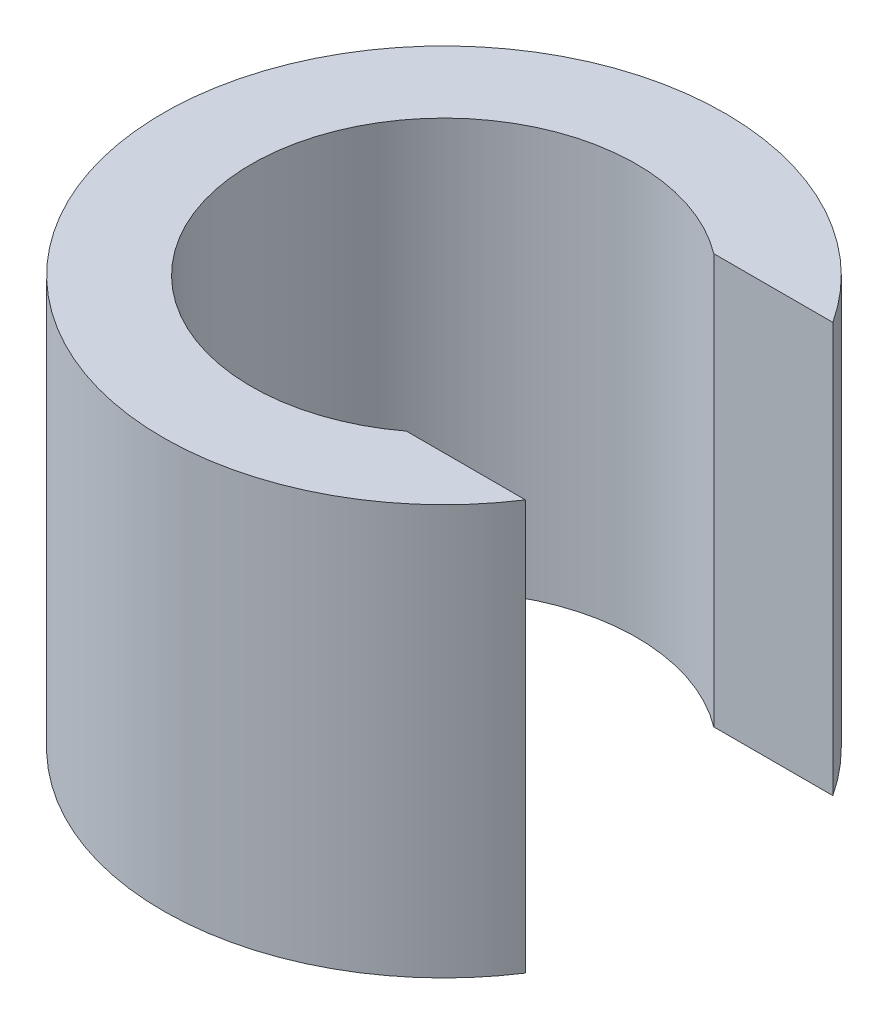
ISO-10303-21;
HEADER;
FILE_DESCRIPTION(('STEP AP214'),'2;1');
FILE_NAME('part.step','',(''),(''),'','','');
FILE_SCHEMA(('AUTOMOTIVE_DESIGN { 1 0 10303 214 1 1 1 1 }'));
ENDSEC;
DATA;
#1=APPLICATION_CONTEXT('core data for automotive mechanical design processes');
#2=APPLICATION_PROTOCOL_DEFINITION('international standard','automotive_design',2000,#1);
#3=PRODUCT_CONTEXT('',#1,'mechanical');
#4=PRODUCT('Part','Part','',(#3));
#5=PRODUCT_RELATED_PRODUCT_CATEGORY('part','',(#4));
#6=PRODUCT_DEFINITION_FORMATION('','',#4);
#7=PRODUCT_DEFINITION_CONTEXT('part definition',#1,'design');
#8=PRODUCT_DEFINITION('design','',#6,#7);
#9=PRODUCT_DEFINITION_SHAPE('','',#8);
#10=(LENGTH_UNIT() NAMED_UNIT(*) SI_UNIT(.MILLI.,.METRE.));
#11=(NAMED_UNIT(*) PLANE_ANGLE_UNIT() SI_UNIT($,.RADIAN.));
#12=(NAMED_UNIT(*) SI_UNIT($,.STERADIAN.) SOLID_ANGLE_UNIT());
#13=UNCERTAINTY_MEASURE_WITH_UNIT(LENGTH_MEASURE(1.E-05),#10,'distance_accuracy_value','');
#14=(GEOMETRIC_REPRESENTATION_CONTEXT(3) GLOBAL_UNCERTAINTY_ASSIGNED_CONTEXT((#13)) GLOBAL_UNIT_ASSIGNED_CONTEXT((#10,
#11,#12)) REPRESENTATION_CONTEXT('',''));
#15=CARTESIAN_POINT('',(0.,0.,0.));
#16=DIRECTION('',(0.,0.,1.));
#17=DIRECTION('',(1.,0.,0.));
#18=AXIS2_PLACEMENT_3D('',#15,#16,#17);
#19=CARTESIAN_POINT('',(0.,25.4,0.));
#20=DIRECTION('',(0.,-1.,0.));
#21=DIRECTION('',(0.,0.,-1.));
#22=AXIS2_PLACEMENT_3D('',#19,#20,#21);
#23=CYLINDRICAL_SURFACE('',#22,11.938);
#24=CARTESIAN_POINT('',(0.,0.,0.));
#25=DIRECTION('',(0.,-1.,0.));
#26=DIRECTION('',(0.,0.,1.));
#27=AXIS2_PLACEMENT_3D('',#24,#25,#26);
#28=CIRCLE('',#27,11.938);
#29=CARTESIAN_POINT('',(7.19654215578565,0.,9.525));
#30=VERTEX_POINT('',#29);
#31=CARTESIAN_POINT('',(7.19654215578565,0.,-9.525));
#32=VERTEX_POINT('',#31);
#33=EDGE_CURVE('E107',#30,#32,#28,.T.);
#34=ORIENTED_EDGE('',*,*,#33,.T.);
#35=DIRECTION('',(0.,-1.,0.));
#36=VECTOR('',#35,1.);
#37=CARTESIAN_POINT('',(7.19654215578565,25.4,-9.525));
#38=LINE('',#37,#36);
#39=CARTESIAN_POINT('',(7.19654215578565,25.4,-9.525));
#40=VERTEX_POINT('',#39);
#41=EDGE_CURVE('E11',#40,#32,#38,.T.);
#42=ORIENTED_EDGE('',*,*,#41,.F.);
#43=CARTESIAN_POINT('',(0.,25.4,0.));
#44=DIRECTION('',(0.,-1.,0.));
#45=DIRECTION('',(0.,0.,1.));
#46=AXIS2_PLACEMENT_3D('',#43,#44,#45);
#47=CIRCLE('',#46,11.938);
#48=CARTESIAN_POINT('',(7.19654215578565,25.4,9.525));
#49=VERTEX_POINT('',#48);
#50=EDGE_CURVE('E91',#49,#40,#47,.T.);
#51=ORIENTED_EDGE('',*,*,#50,.F.);
#52=DIRECTION('',(0.,-1.,0.));
#53=VECTOR('',#52,1.);
#54=CARTESIAN_POINT('',(7.19654215578565,25.4,9.525));
#55=LINE('',#54,#53);
#56=EDGE_CURVE('E103',#49,#30,#55,.T.);
#57=ORIENTED_EDGE('',*,*,#56,.T.);
#58=EDGE_LOOP('',(#34,#42,#51,#57));
#59=FACE_BOUND('',#58,.T.);
#60=ADVANCED_FACE('F39',(#59),#23,.F.);
#61=CARTESIAN_POINT('',(7.19654215578565,25.4,-9.525));
#62=DIRECTION('',(0.,0.,-1.));
#63=DIRECTION('',(-1.,0.,0.));
#64=AXIS2_PLACEMENT_3D('',#61,#62,#63);
#65=PLANE('',#64);
#66=DIRECTION('',(1.,0.,0.));
#67=VECTOR('',#66,1.);
#68=CARTESIAN_POINT('',(7.19654215578565,0.,-9.525));
#69=LINE('',#68,#67);
#70=CARTESIAN_POINT('',(14.5753789621402,0.,-9.525));
#71=VERTEX_POINT('',#70);
#72=EDGE_CURVE('E96',#32,#71,#69,.T.);
#73=ORIENTED_EDGE('',*,*,#72,.T.);
#74=DIRECTION('',(0.,-1.,0.));
#75=VECTOR('',#74,1.);
#76=CARTESIAN_POINT('',(14.5753789621402,25.4,-9.525));
#77=LINE('',#76,#75);
#78=CARTESIAN_POINT('',(14.5753789621402,25.4,-9.525));
#79=VERTEX_POINT('',#78);
#80=EDGE_CURVE('E48',#79,#71,#77,.T.);
#81=ORIENTED_EDGE('',*,*,#80,.F.);
#82=DIRECTION('',(1.,0.,0.));
#83=VECTOR('',#82,1.);
#84=CARTESIAN_POINT('',(7.19654215578565,25.4,-9.525));
#85=LINE('',#84,#83);
#86=EDGE_CURVE('E86',#40,#79,#85,.T.);
#87=ORIENTED_EDGE('',*,*,#86,.F.);
#88=ORIENTED_EDGE('',*,*,#41,.T.);
#89=EDGE_LOOP('',(#73,#81,#87,#88));
#90=FACE_BOUND('',#89,.T.);
#91=ADVANCED_FACE('F95',(#90),#65,.F.);
#92=CARTESIAN_POINT('',(0.,25.4,0.));
#93=DIRECTION('',(0.,-1.,0.));
#94=DIRECTION('',(0.,0.,-1.));
#95=AXIS2_PLACEMENT_3D('',#92,#93,#94);
#96=CYLINDRICAL_SURFACE('',#95,17.4117);
#97=CARTESIAN_POINT('',(0.,0.,0.));
#98=DIRECTION('',(0.,1.,0.));
#99=DIRECTION('',(0.,0.,1.));
#100=AXIS2_PLACEMENT_3D('',#97,#98,#99);
#101=CIRCLE('',#100,17.4117);
#102=CARTESIAN_POINT('',(14.5753789621402,0.,9.525));
#103=VERTEX_POINT('',#102);
#104=EDGE_CURVE('E73',#71,#103,#101,.T.);
#105=ORIENTED_EDGE('',*,*,#104,.T.);
#106=DIRECTION('',(0.,-1.,0.));
#107=VECTOR('',#106,1.);
#108=CARTESIAN_POINT('',(14.5753789621402,25.4,9.525));
#109=LINE('',#108,#107);
#110=CARTESIAN_POINT('',(14.5753789621402,25.4,9.525));
#111=VERTEX_POINT('',#110);
#112=EDGE_CURVE('E98',#111,#103,#109,.T.);
#113=ORIENTED_EDGE('',*,*,#112,.F.);
#114=CARTESIAN_POINT('',(0.,25.4,0.));
#115=DIRECTION('',(0.,1.,0.));
#116=DIRECTION('',(0.,0.,1.));
#117=AXIS2_PLACEMENT_3D('',#114,#115,#116);
#118=CIRCLE('',#117,17.4117);
#119=EDGE_CURVE('E89',#79,#111,#118,.T.);
#120=ORIENTED_EDGE('',*,*,#119,.F.);
#121=ORIENTED_EDGE('',*,*,#80,.T.);
#122=EDGE_LOOP('',(#105,#113,#120,#121));
#123=FACE_BOUND('',#122,.T.);
#124=ADVANCED_FACE('F99',(#123),#96,.T.);
#125=CARTESIAN_POINT('',(14.5753789621402,25.4,9.525));
#126=DIRECTION('',(0.,0.,1.));
#127=DIRECTION('',(1.,0.,0.));
#128=AXIS2_PLACEMENT_3D('',#125,#126,#127);
#129=PLANE('',#128);
#130=DIRECTION('',(-1.,0.,0.));
#131=VECTOR('',#130,1.);
#132=CARTESIAN_POINT('',(14.5753789621402,0.,9.525));
#133=LINE('',#132,#131);
#134=EDGE_CURVE('E79',#103,#30,#133,.T.);
#135=ORIENTED_EDGE('',*,*,#134,.T.);
#136=ORIENTED_EDGE('',*,*,#56,.F.);
#137=DIRECTION('',(-1.,0.,0.));
#138=VECTOR('',#137,1.);
#139=CARTESIAN_POINT('',(14.5753789621402,25.4,9.525));
#140=LINE('',#139,#138);
#141=EDGE_CURVE('E56',#111,#49,#140,.T.);
#142=ORIENTED_EDGE('',*,*,#141,.F.);
#143=ORIENTED_EDGE('',*,*,#112,.T.);
#144=EDGE_LOOP('',(#135,#136,#142,#143));
#145=FACE_BOUND('',#144,.T.);
#146=ADVANCED_FACE('F120',(#145),#129,.F.);
#147=CARTESIAN_POINT('',(0.,25.4,0.));
#148=DIRECTION('',(0.,1.,0.));
#149=DIRECTION('',(0.,0.,1.));
#150=AXIS2_PLACEMENT_3D('',#147,#148,#149);
#151=PLANE('',#150);
#152=ORIENTED_EDGE('',*,*,#50,.T.);
#153=ORIENTED_EDGE('',*,*,#86,.T.);
#154=ORIENTED_EDGE('',*,*,#119,.T.);
#155=ORIENTED_EDGE('',*,*,#141,.T.);
#156=EDGE_LOOP('',(#152,#153,#154,#155));
#157=FACE_BOUND('',#156,.T.);
#158=ADVANCED_FACE('F87',(#157),#151,.T.);
#159=CARTESIAN_POINT('',(0.,0.,0.));
#160=DIRECTION('',(0.,1.,0.));
#161=DIRECTION('',(0.,0.,1.));
#162=AXIS2_PLACEMENT_3D('',#159,#160,#161);
#163=PLANE('',#162);
#164=ORIENTED_EDGE('',*,*,#33,.F.);
#165=ORIENTED_EDGE('',*,*,#134,.F.);
#166=ORIENTED_EDGE('',*,*,#104,.F.);
#167=ORIENTED_EDGE('',*,*,#72,.F.);
#168=EDGE_LOOP('',(#164,#165,#166,#167));
#169=FACE_BOUND('',#168,.T.);
#170=ADVANCED_FACE('F123',(#169),#163,.F.);
#171=CLOSED_SHELL('',(#60,#91,#124,#146,#158,#170));
#172=MANIFOLD_SOLID_BREP('B2',#171);
#173=ADVANCED_BREP_SHAPE_REPRESENTATION('',(#18,#172),#14);
#174=SHAPE_DEFINITION_REPRESENTATION(#9,#173);
ENDSEC;
END-ISO-10303-21;
